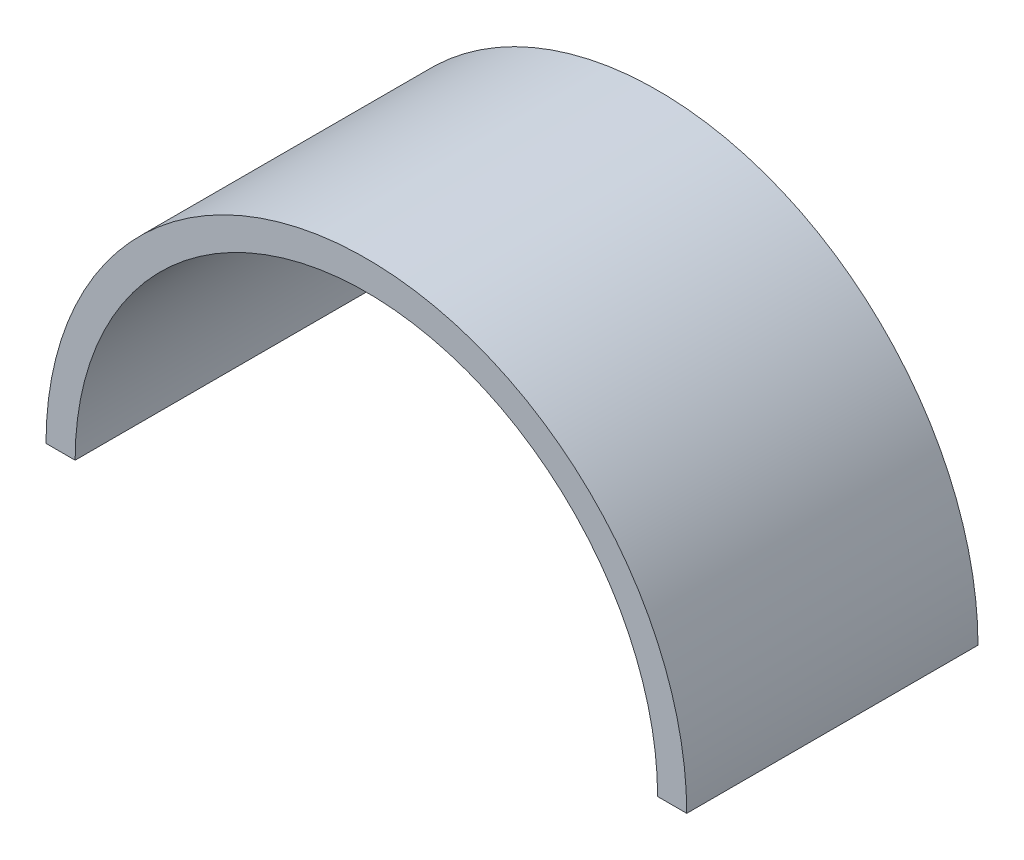
ISO-10303-21;
HEADER;
FILE_DESCRIPTION(('STEP AP214'),'2;1');
FILE_NAME('part.step','',(''),(''),'','','');
FILE_SCHEMA(('AUTOMOTIVE_DESIGN { 1 0 10303 214 1 1 1 1 }'));
ENDSEC;
DATA;
#1=APPLICATION_CONTEXT('core data for automotive mechanical design processes');
#2=APPLICATION_PROTOCOL_DEFINITION('international standard','automotive_design',2000,#1);
#3=PRODUCT_CONTEXT('',#1,'mechanical');
#4=PRODUCT('Part','Part','',(#3));
#5=PRODUCT_RELATED_PRODUCT_CATEGORY('part','',(#4));
#6=PRODUCT_DEFINITION_FORMATION('','',#4);
#7=PRODUCT_DEFINITION_CONTEXT('part definition',#1,'design');
#8=PRODUCT_DEFINITION('design','',#6,#7);
#9=PRODUCT_DEFINITION_SHAPE('','',#8);
#10=(LENGTH_UNIT() NAMED_UNIT(*) SI_UNIT(.MILLI.,.METRE.));
#11=(NAMED_UNIT(*) PLANE_ANGLE_UNIT() SI_UNIT($,.RADIAN.));
#12=(NAMED_UNIT(*) SI_UNIT($,.STERADIAN.) SOLID_ANGLE_UNIT());
#13=UNCERTAINTY_MEASURE_WITH_UNIT(LENGTH_MEASURE(1.E-05),#10,'distance_accuracy_value','');
#14=(GEOMETRIC_REPRESENTATION_CONTEXT(3) GLOBAL_UNCERTAINTY_ASSIGNED_CONTEXT((#13)) GLOBAL_UNIT_ASSIGNED_CONTEXT((#10,
#11,#12)) REPRESENTATION_CONTEXT('',''));
#15=CARTESIAN_POINT('',(0.,0.,0.));
#16=DIRECTION('',(0.,0.,1.));
#17=DIRECTION('',(1.,0.,0.));
#18=AXIS2_PLACEMENT_3D('',#15,#16,#17);
#19=CARTESIAN_POINT('',(0.,0.,50.));
#20=DIRECTION('',(0.,0.,-1.));
#21=DIRECTION('',(-1.,0.,0.));
#22=AXIS2_PLACEMENT_3D('',#19,#20,#21);
#23=CYLINDRICAL_SURFACE('',#22,55.);
#24=CARTESIAN_POINT('',(0.,0.,0.));
#25=DIRECTION('',(0.,0.,1.));
#26=DIRECTION('',(1.,0.,0.));
#27=AXIS2_PLACEMENT_3D('',#24,#25,#26);
#28=CIRCLE('',#27,55.);
#29=CARTESIAN_POINT('',(55.,0.,0.));
#30=VERTEX_POINT('',#29);
#31=CARTESIAN_POINT('',(-55.,0.,0.));
#32=VERTEX_POINT('',#31);
#33=EDGE_CURVE('E107',#30,#32,#28,.T.);
#34=ORIENTED_EDGE('',*,*,#33,.T.);
#35=DIRECTION('',(0.,0.,-1.));
#36=VECTOR('',#35,1.);
#37=CARTESIAN_POINT('',(-55.,0.,50.));
#38=LINE('',#37,#36);
#39=CARTESIAN_POINT('',(-55.,0.,50.));
#40=VERTEX_POINT('',#39);
#41=EDGE_CURVE('E11',#40,#32,#38,.T.);
#42=ORIENTED_EDGE('',*,*,#41,.F.);
#43=CARTESIAN_POINT('',(0.,0.,50.));
#44=DIRECTION('',(0.,0.,1.));
#45=DIRECTION('',(1.,0.,0.));
#46=AXIS2_PLACEMENT_3D('',#43,#44,#45);
#47=CIRCLE('',#46,55.);
#48=CARTESIAN_POINT('',(55.,0.,50.));
#49=VERTEX_POINT('',#48);
#50=EDGE_CURVE('E91',#49,#40,#47,.T.);
#51=ORIENTED_EDGE('',*,*,#50,.F.);
#52=DIRECTION('',(0.,0.,-1.));
#53=VECTOR('',#52,1.);
#54=CARTESIAN_POINT('',(55.,0.,50.));
#55=LINE('',#54,#53);
#56=EDGE_CURVE('E103',#49,#30,#55,.T.);
#57=ORIENTED_EDGE('',*,*,#56,.T.);
#58=EDGE_LOOP('',(#34,#42,#51,#57));
#59=FACE_BOUND('',#58,.T.);
#60=ADVANCED_FACE('F39',(#59),#23,.T.);
#61=CARTESIAN_POINT('',(-50.,0.,50.));
#62=DIRECTION('',(0.,1.,0.));
#63=DIRECTION('',(0.,0.,1.));
#64=AXIS2_PLACEMENT_3D('',#61,#62,#63);
#65=PLANE('',#64);
#66=DIRECTION('',(1.,0.,0.));
#67=VECTOR('',#66,1.);
#68=CARTESIAN_POINT('',(-50.,0.,0.));
#69=LINE('',#68,#67);
#70=CARTESIAN_POINT('',(-50.,0.,0.));
#71=VERTEX_POINT('',#70);
#72=EDGE_CURVE('E96',#32,#71,#69,.T.);
#73=ORIENTED_EDGE('',*,*,#72,.T.);
#74=DIRECTION('',(0.,0.,-1.));
#75=VECTOR('',#74,1.);
#76=CARTESIAN_POINT('',(-50.,0.,50.));
#77=LINE('',#76,#75);
#78=CARTESIAN_POINT('',(-50.,0.,50.));
#79=VERTEX_POINT('',#78);
#80=EDGE_CURVE('E48',#79,#71,#77,.T.);
#81=ORIENTED_EDGE('',*,*,#80,.F.);
#82=DIRECTION('',(1.,0.,0.));
#83=VECTOR('',#82,1.);
#84=CARTESIAN_POINT('',(-50.,0.,50.));
#85=LINE('',#84,#83);
#86=EDGE_CURVE('E86',#40,#79,#85,.T.);
#87=ORIENTED_EDGE('',*,*,#86,.F.);
#88=ORIENTED_EDGE('',*,*,#41,.T.);
#89=EDGE_LOOP('',(#73,#81,#87,#88));
#90=FACE_BOUND('',#89,.T.);
#91=ADVANCED_FACE('F95',(#90),#65,.F.);
#92=CARTESIAN_POINT('',(0.,0.,50.));
#93=DIRECTION('',(0.,0.,-1.));
#94=DIRECTION('',(-1.,0.,0.));
#95=AXIS2_PLACEMENT_3D('',#92,#93,#94);
#96=CYLINDRICAL_SURFACE('',#95,50.);
#97=CARTESIAN_POINT('',(0.,0.,0.));
#98=DIRECTION('',(0.,0.,-1.));
#99=DIRECTION('',(1.,0.,0.));
#100=AXIS2_PLACEMENT_3D('',#97,#98,#99);
#101=CIRCLE('',#100,50.);
#102=CARTESIAN_POINT('',(50.,0.,0.));
#103=VERTEX_POINT('',#102);
#104=EDGE_CURVE('E73',#71,#103,#101,.T.);
#105=ORIENTED_EDGE('',*,*,#104,.T.);
#106=DIRECTION('',(0.,0.,-1.));
#107=VECTOR('',#106,1.);
#108=CARTESIAN_POINT('',(50.,0.,50.));
#109=LINE('',#108,#107);
#110=CARTESIAN_POINT('',(50.,0.,50.));
#111=VERTEX_POINT('',#110);
#112=EDGE_CURVE('E98',#111,#103,#109,.T.);
#113=ORIENTED_EDGE('',*,*,#112,.F.);
#114=CARTESIAN_POINT('',(0.,0.,50.));
#115=DIRECTION('',(0.,0.,-1.));
#116=DIRECTION('',(1.,0.,0.));
#117=AXIS2_PLACEMENT_3D('',#114,#115,#116);
#118=CIRCLE('',#117,50.);
#119=EDGE_CURVE('E89',#79,#111,#118,.T.);
#120=ORIENTED_EDGE('',*,*,#119,.F.);
#121=ORIENTED_EDGE('',*,*,#80,.T.);
#122=EDGE_LOOP('',(#105,#113,#120,#121));
#123=FACE_BOUND('',#122,.T.);
#124=ADVANCED_FACE('F99',(#123),#96,.F.);
#125=CARTESIAN_POINT('',(55.,0.,50.));
#126=DIRECTION('',(0.,1.,0.));
#127=DIRECTION('',(0.,0.,1.));
#128=AXIS2_PLACEMENT_3D('',#125,#126,#127);
#129=PLANE('',#128);
#130=DIRECTION('',(1.,0.,0.));
#131=VECTOR('',#130,1.);
#132=CARTESIAN_POINT('',(55.,0.,0.));
#133=LINE('',#132,#131);
#134=EDGE_CURVE('E79',#103,#30,#133,.T.);
#135=ORIENTED_EDGE('',*,*,#134,.T.);
#136=ORIENTED_EDGE('',*,*,#56,.F.);
#137=DIRECTION('',(1.,0.,0.));
#138=VECTOR('',#137,1.);
#139=CARTESIAN_POINT('',(55.,0.,50.));
#140=LINE('',#139,#138);
#141=EDGE_CURVE('E56',#111,#49,#140,.T.);
#142=ORIENTED_EDGE('',*,*,#141,.F.);
#143=ORIENTED_EDGE('',*,*,#112,.T.);
#144=EDGE_LOOP('',(#135,#136,#142,#143));
#145=FACE_BOUND('',#144,.T.);
#146=ADVANCED_FACE('F121',(#145),#129,.F.);
#147=CARTESIAN_POINT('',(0.,0.,50.));
#148=DIRECTION('',(0.,0.,1.));
#149=DIRECTION('',(1.,0.,0.));
#150=AXIS2_PLACEMENT_3D('',#147,#148,#149);
#151=PLANE('',#150);
#152=ORIENTED_EDGE('',*,*,#50,.T.);
#153=ORIENTED_EDGE('',*,*,#86,.T.);
#154=ORIENTED_EDGE('',*,*,#119,.T.);
#155=ORIENTED_EDGE('',*,*,#141,.T.);
#156=EDGE_LOOP('',(#152,#153,#154,#155));
#157=FACE_BOUND('',#156,.T.);
#158=ADVANCED_FACE('F87',(#157),#151,.T.);
#159=CARTESIAN_POINT('',(0.,0.,0.));
#160=DIRECTION('',(0.,0.,1.));
#161=DIRECTION('',(1.,0.,0.));
#162=AXIS2_PLACEMENT_3D('',#159,#160,#161);
#163=PLANE('',#162);
#164=CARTESIAN_POINT('',(0.,52.5,0.));
#165=DIRECTION('',(0.,0.,-1.));
#166=DIRECTION('',(-1.,0.,0.));
#167=AXIS2_PLACEMENT_3D('',#164,#165,#166);
#168=CIRCLE('',#167,1.6);
#169=CARTESIAN_POINT('',(-1.6,52.5,0.));
#170=VERTEX_POINT('',#169);
#171=EDGE_CURVE('E145',#170,#170,#168,.T.);
#172=ORIENTED_EDGE('',*,*,#171,.F.);
#173=EDGE_LOOP('',(#172));
#174=FACE_BOUND('',#173,.T.);
#175=CARTESIAN_POINT('',(33.7463495085446,40.2173332637478,0.));
#176=DIRECTION('',(0.,0.,-1.));
#177=DIRECTION('',(1.,0.,0.));
#178=AXIS2_PLACEMENT_3D('',#175,#176,#177);
#179=CIRCLE('',#178,1.59999999999945);
#180=CARTESIAN_POINT('',(35.346349508544,40.2173332637478,0.));
#181=VERTEX_POINT('',#180);
#182=EDGE_CURVE('E146',#181,#181,#179,.T.);
#183=ORIENTED_EDGE('',*,*,#182,.F.);
#184=EDGE_LOOP('',(#183));
#185=FACE_BOUND('',#184,.T.);
#186=CARTESIAN_POINT('',(-51.7024070331436,9.11652932751524,0.));
#187=DIRECTION('',(0.,0.,-1.));
#188=DIRECTION('',(-1.,0.,0.));
#189=AXIS2_PLACEMENT_3D('',#186,#187,#188);
#190=CIRCLE('',#189,1.60000000000015);
#191=CARTESIAN_POINT('',(-53.3024070331438,9.11652932751524,0.));
#192=VERTEX_POINT('',#191);
#193=EDGE_CURVE('E154',#192,#192,#190,.T.);
#194=ORIENTED_EDGE('',*,*,#193,.F.);
#195=EDGE_LOOP('',(#194));
#196=FACE_BOUND('',#195,.T.);
#197=CARTESIAN_POINT('',(-33.7463495085446,40.2173332637478,0.));
#198=DIRECTION('',(0.,0.,-1.));
#199=DIRECTION('',(-1.,0.,0.));
#200=AXIS2_PLACEMENT_3D('',#197,#198,#199);
#201=CIRCLE('',#200,1.59999999999945);
#202=CARTESIAN_POINT('',(-35.346349508544,40.2173332637478,0.));
#203=VERTEX_POINT('',#202);
#204=EDGE_CURVE('E128',#203,#203,#201,.T.);
#205=ORIENTED_EDGE('',*,*,#204,.F.);
#206=EDGE_LOOP('',(#205));
#207=FACE_BOUND('',#206,.T.);
#208=CARTESIAN_POINT('',(51.7024070331436,9.11652932751524,0.));
#209=DIRECTION('',(0.,0.,-1.));
#210=DIRECTION('',(1.,0.,0.));
#211=AXIS2_PLACEMENT_3D('',#208,#209,#210);
#212=CIRCLE('',#211,1.60000000000015);
#213=CARTESIAN_POINT('',(53.3024070331438,9.11652932751524,0.));
#214=VERTEX_POINT('',#213);
#215=EDGE_CURVE('E137',#214,#214,#212,.T.);
#216=ORIENTED_EDGE('',*,*,#215,.F.);
#217=EDGE_LOOP('',(#216));
#218=FACE_BOUND('',#217,.T.);
#219=ORIENTED_EDGE('',*,*,#33,.F.);
#220=ORIENTED_EDGE('',*,*,#134,.F.);
#221=ORIENTED_EDGE('',*,*,#104,.F.);
#222=ORIENTED_EDGE('',*,*,#72,.F.);
#223=EDGE_LOOP('',(#219,#220,#221,#222));
#224=FACE_BOUND('',#223,.T.);
#225=ADVANCED_FACE('F124',(#174,#185,#196,#207,#218,#224),#163,.F.);
#226=CARTESIAN_POINT('',(51.7024070331436,9.11652932751524,10.));
#227=DIRECTION('',(0.,0.,-1.));
#228=DIRECTION('',(-1.,0.,0.));
#229=AXIS2_PLACEMENT_3D('',#226,#227,#228);
#230=CYLINDRICAL_SURFACE('',#229,1.60000000000015);
#231=CARTESIAN_POINT('',(51.7024070331436,9.11652932751524,10.));
#232=DIRECTION('',(0.,0.,-1.));
#233=DIRECTION('',(1.,0.,0.));
#234=AXIS2_PLACEMENT_3D('',#231,#232,#233);
#235=CIRCLE('',#234,1.60000000000015);
#236=CARTESIAN_POINT('',(53.3024070331438,9.11652932751524,10.));
#237=VERTEX_POINT('',#236);
#238=EDGE_CURVE('E141',#237,#237,#235,.T.);
#239=ORIENTED_EDGE('',*,*,#238,.F.);
#240=EDGE_LOOP('',(#239));
#241=FACE_BOUND('',#240,.T.);
#242=ORIENTED_EDGE('',*,*,#215,.T.);
#243=EDGE_LOOP('',(#242));
#244=FACE_BOUND('',#243,.T.);
#245=ADVANCED_FACE('F179',(#241,#244),#230,.F.);
#246=CARTESIAN_POINT('',(51.7024070331436,9.11652932751524,10.));
#247=DIRECTION('',(0.,0.,1.));
#248=DIRECTION('',(1.,0.,0.));
#249=AXIS2_PLACEMENT_3D('',#246,#247,#248);
#250=PLANE('',#249);
#251=ORIENTED_EDGE('',*,*,#238,.T.);
#252=EDGE_LOOP('',(#251));
#253=FACE_BOUND('',#252,.T.);
#254=ADVANCED_FACE('F190',(#253),#250,.F.);
#255=CARTESIAN_POINT('',(-33.7463495085446,40.2173332637478,10.));
#256=DIRECTION('',(0.,0.,-1.));
#257=DIRECTION('',(-1.,0.,0.));
#258=AXIS2_PLACEMENT_3D('',#255,#256,#257);
#259=CYLINDRICAL_SURFACE('',#258,1.59999999999945);
#260=CARTESIAN_POINT('',(-33.7463495085446,40.2173332637478,10.));
#261=DIRECTION('',(0.,0.,-1.));
#262=DIRECTION('',(-1.,0.,0.));
#263=AXIS2_PLACEMENT_3D('',#260,#261,#262);
#264=CIRCLE('',#263,1.59999999999945);
#265=CARTESIAN_POINT('',(-35.346349508544,40.2173332637478,10.));
#266=VERTEX_POINT('',#265);
#267=EDGE_CURVE('E132',#266,#266,#264,.T.);
#268=ORIENTED_EDGE('',*,*,#267,.F.);
#269=EDGE_LOOP('',(#268));
#270=FACE_BOUND('',#269,.T.);
#271=ORIENTED_EDGE('',*,*,#204,.T.);
#272=EDGE_LOOP('',(#271));
#273=FACE_BOUND('',#272,.T.);
#274=ADVANCED_FACE('F196',(#270,#273),#259,.F.);
#275=CARTESIAN_POINT('',(-33.7463495085446,40.2173332637478,10.));
#276=DIRECTION('',(0.,0.,-1.));
#277=DIRECTION('',(-1.,0.,0.));
#278=AXIS2_PLACEMENT_3D('',#275,#276,#277);
#279=PLANE('',#278);
#280=ORIENTED_EDGE('',*,*,#267,.T.);
#281=EDGE_LOOP('',(#280));
#282=FACE_BOUND('',#281,.T.);
#283=ADVANCED_FACE('F215',(#282),#279,.T.);
#284=CARTESIAN_POINT('',(-51.7024070331436,9.11652932751524,10.));
#285=DIRECTION('',(0.,0.,-1.));
#286=DIRECTION('',(-1.,0.,0.));
#287=AXIS2_PLACEMENT_3D('',#284,#285,#286);
#288=CYLINDRICAL_SURFACE('',#287,1.60000000000015);
#289=CARTESIAN_POINT('',(-51.7024070331436,9.11652932751524,10.));
#290=DIRECTION('',(0.,0.,-1.));
#291=DIRECTION('',(-1.,0.,0.));
#292=AXIS2_PLACEMENT_3D('',#289,#290,#291);
#293=CIRCLE('',#292,1.60000000000015);
#294=CARTESIAN_POINT('',(-53.3024070331438,9.11652932751524,10.));
#295=VERTEX_POINT('',#294);
#296=EDGE_CURVE('E133',#295,#295,#293,.T.);
#297=ORIENTED_EDGE('',*,*,#296,.F.);
#298=EDGE_LOOP('',(#297));
#299=FACE_BOUND('',#298,.T.);
#300=ORIENTED_EDGE('',*,*,#193,.T.);
#301=EDGE_LOOP('',(#300));
#302=FACE_BOUND('',#301,.T.);
#303=ADVANCED_FACE('F218',(#299,#302),#288,.F.);
#304=CARTESIAN_POINT('',(-51.7024070331436,9.11652932751524,10.));
#305=DIRECTION('',(0.,0.,-1.));
#306=DIRECTION('',(-1.,0.,0.));
#307=AXIS2_PLACEMENT_3D('',#304,#305,#306);
#308=PLANE('',#307);
#309=ORIENTED_EDGE('',*,*,#296,.T.);
#310=EDGE_LOOP('',(#309));
#311=FACE_BOUND('',#310,.T.);
#312=ADVANCED_FACE('F223',(#311),#308,.T.);
#313=CARTESIAN_POINT('',(33.7463495085446,40.2173332637478,10.));
#314=DIRECTION('',(0.,0.,-1.));
#315=DIRECTION('',(-1.,0.,0.));
#316=AXIS2_PLACEMENT_3D('',#313,#314,#315);
#317=CYLINDRICAL_SURFACE('',#316,1.59999999999945);
#318=CARTESIAN_POINT('',(33.7463495085446,40.2173332637478,10.));
#319=DIRECTION('',(0.,0.,-1.));
#320=DIRECTION('',(1.,0.,0.));
#321=AXIS2_PLACEMENT_3D('',#318,#319,#320);
#322=CIRCLE('',#321,1.59999999999945);
#323=CARTESIAN_POINT('',(35.346349508544,40.2173332637478,10.));
#324=VERTEX_POINT('',#323);
#325=EDGE_CURVE('E150',#324,#324,#322,.T.);
#326=ORIENTED_EDGE('',*,*,#325,.F.);
#327=EDGE_LOOP('',(#326));
#328=FACE_BOUND('',#327,.T.);
#329=ORIENTED_EDGE('',*,*,#182,.T.);
#330=EDGE_LOOP('',(#329));
#331=FACE_BOUND('',#330,.T.);
#332=ADVANCED_FACE('F231',(#328,#331),#317,.F.);
#333=CARTESIAN_POINT('',(33.7463495085446,40.2173332637478,10.));
#334=DIRECTION('',(0.,0.,1.));
#335=DIRECTION('',(1.,0.,0.));
#336=AXIS2_PLACEMENT_3D('',#333,#334,#335);
#337=PLANE('',#336);
#338=ORIENTED_EDGE('',*,*,#325,.T.);
#339=EDGE_LOOP('',(#338));
#340=FACE_BOUND('',#339,.T.);
#341=ADVANCED_FACE('F173',(#340),#337,.F.);
#342=CARTESIAN_POINT('',(0.,52.5,10.));
#343=DIRECTION('',(0.,0.,-1.));
#344=DIRECTION('',(-1.,0.,0.));
#345=AXIS2_PLACEMENT_3D('',#342,#343,#344);
#346=CYLINDRICAL_SURFACE('',#345,1.6);
#347=CARTESIAN_POINT('',(0.,52.5,10.));
#348=DIRECTION('',(0.,0.,-1.));
#349=DIRECTION('',(-1.,0.,0.));
#350=AXIS2_PLACEMENT_3D('',#347,#348,#349);
#351=CIRCLE('',#350,1.6);
#352=CARTESIAN_POINT('',(-1.6,52.5,10.));
#353=VERTEX_POINT('',#352);
#354=EDGE_CURVE('E111',#353,#353,#351,.T.);
#355=ORIENTED_EDGE('',*,*,#354,.F.);
#356=EDGE_LOOP('',(#355));
#357=FACE_BOUND('',#356,.T.);
#358=ORIENTED_EDGE('',*,*,#171,.T.);
#359=EDGE_LOOP('',(#358));
#360=FACE_BOUND('',#359,.T.);
#361=ADVANCED_FACE('F170',(#357,#360),#346,.F.);
#362=CARTESIAN_POINT('',(0.,52.5,10.));
#363=DIRECTION('',(0.,0.,-1.));
#364=DIRECTION('',(-1.,0.,0.));
#365=AXIS2_PLACEMENT_3D('',#362,#363,#364);
#366=PLANE('',#365);
#367=ORIENTED_EDGE('',*,*,#354,.T.);
#368=EDGE_LOOP('',(#367));
#369=FACE_BOUND('',#368,.T.);
#370=ADVANCED_FACE('F168',(#369),#366,.T.);
#371=CLOSED_SHELL('',(#60,#91,#124,#146,#158,#225,#245,#254,#274,#283,#303,#312,#332,#341,#361,#370));
#372=MANIFOLD_SOLID_BREP('B2',#371);
#373=ADVANCED_BREP_SHAPE_REPRESENTATION('',(#18,#372),#14);
#374=SHAPE_DEFINITION_REPRESENTATION(#9,#373);
ENDSEC;
END-ISO-10303-21;
